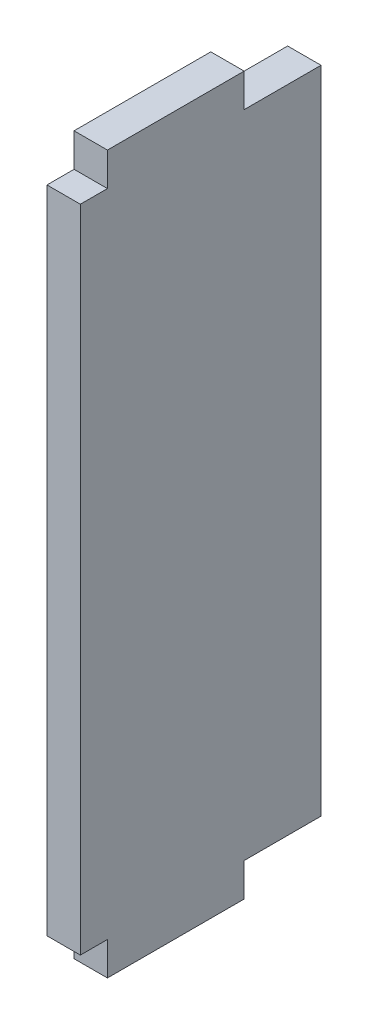
ISO-10303-21;
HEADER;
FILE_DESCRIPTION(('STEP AP214'),'2;1');
FILE_NAME('part.step','',(''),(''),'','','');
FILE_SCHEMA(('AUTOMOTIVE_DESIGN { 1 0 10303 214 1 1 1 1 }'));
ENDSEC;
DATA;
#1=APPLICATION_CONTEXT('core data for automotive mechanical design processes');
#2=APPLICATION_PROTOCOL_DEFINITION('international standard','automotive_design',2000,#1);
#3=PRODUCT_CONTEXT('',#1,'mechanical');
#4=PRODUCT('Part','Part','',(#3));
#5=PRODUCT_RELATED_PRODUCT_CATEGORY('part','',(#4));
#6=PRODUCT_DEFINITION_FORMATION('','',#4);
#7=PRODUCT_DEFINITION_CONTEXT('part definition',#1,'design');
#8=PRODUCT_DEFINITION('design','',#6,#7);
#9=PRODUCT_DEFINITION_SHAPE('','',#8);
#10=(LENGTH_UNIT() NAMED_UNIT(*) SI_UNIT(.MILLI.,.METRE.));
#11=(NAMED_UNIT(*) PLANE_ANGLE_UNIT() SI_UNIT($,.RADIAN.));
#12=(NAMED_UNIT(*) SI_UNIT($,.STERADIAN.) SOLID_ANGLE_UNIT());
#13=UNCERTAINTY_MEASURE_WITH_UNIT(LENGTH_MEASURE(1.E-05),#10,'distance_accuracy_value','');
#14=(GEOMETRIC_REPRESENTATION_CONTEXT(3) GLOBAL_UNCERTAINTY_ASSIGNED_CONTEXT((#13)) GLOBAL_UNIT_ASSIGNED_CONTEXT((#10,
#11,#12)) REPRESENTATION_CONTEXT('',''));
#15=CARTESIAN_POINT('',(0.,0.,0.));
#16=DIRECTION('',(0.,0.,1.));
#17=DIRECTION('',(1.,0.,0.));
#18=AXIS2_PLACEMENT_3D('',#15,#16,#17);
#19=CARTESIAN_POINT('',(2.44,23.78,-3.17999999999999));
#20=DIRECTION('',(0.,-1.,0.));
#21=DIRECTION('',(0.,0.,-1.));
#22=AXIS2_PLACEMENT_3D('',#19,#20,#21);
#23=PLANE('',#22);
#24=DIRECTION('',(0.,0.,1.));
#25=VECTOR('',#24,1.);
#26=CARTESIAN_POINT('',(0.,23.78,-3.17999999999999));
#27=LINE('',#26,#25);
#28=CARTESIAN_POINT('',(0.,23.78,-8.8));
#29=VERTEX_POINT('',#28);
#30=CARTESIAN_POINT('',(0.,23.78,-3.17999999999999));
#31=VERTEX_POINT('',#30);
#32=EDGE_CURVE('E155',#29,#31,#27,.T.);
#33=ORIENTED_EDGE('',*,*,#32,.T.);
#34=DIRECTION('',(-1.,0.,0.));
#35=VECTOR('',#34,1.);
#36=CARTESIAN_POINT('',(2.44,23.78,-3.17999999999999));
#37=LINE('',#36,#35);
#38=CARTESIAN_POINT('',(2.44,23.78,-3.17999999999999));
#39=VERTEX_POINT('',#38);
#40=EDGE_CURVE('E11',#39,#31,#37,.T.);
#41=ORIENTED_EDGE('',*,*,#40,.F.);
#42=DIRECTION('',(0.,0.,1.));
#43=VECTOR('',#42,1.);
#44=CARTESIAN_POINT('',(2.44,23.78,-3.17999999999999));
#45=LINE('',#44,#43);
#46=CARTESIAN_POINT('',(2.44,23.78,-8.8));
#47=VERTEX_POINT('',#46);
#48=EDGE_CURVE('E177',#47,#39,#45,.T.);
#49=ORIENTED_EDGE('',*,*,#48,.F.);
#50=DIRECTION('',(-1.,0.,0.));
#51=VECTOR('',#50,1.);
#52=CARTESIAN_POINT('',(2.44,23.78,-8.8));
#53=LINE('',#52,#51);
#54=EDGE_CURVE('E151',#47,#29,#53,.T.);
#55=ORIENTED_EDGE('',*,*,#54,.T.);
#56=EDGE_LOOP('',(#33,#41,#49,#55));
#57=FACE_BOUND('',#56,.T.);
#58=ADVANCED_FACE('F35',(#57),#23,.F.);
#59=CARTESIAN_POINT('',(2.44,23.78,-3.17999999999999));
#60=DIRECTION('',(0.,0.,1.));
#61=DIRECTION('',(0.,-1.,0.));
#62=AXIS2_PLACEMENT_3D('',#59,#60,#61);
#63=PLANE('',#62);
#64=DIRECTION('',(0.,1.,0.));
#65=VECTOR('',#64,1.);
#66=CARTESIAN_POINT('',(0.,23.78,-3.17999999999999));
#67=LINE('',#66,#65);
#68=CARTESIAN_POINT('',(0.,26.22,-3.17999999999999));
#69=VERTEX_POINT('',#68);
#70=EDGE_CURVE('E158',#31,#69,#67,.T.);
#71=ORIENTED_EDGE('',*,*,#70,.T.);
#72=DIRECTION('',(-1.,0.,0.));
#73=VECTOR('',#72,1.);
#74=CARTESIAN_POINT('',(2.44,26.22,-3.17999999999999));
#75=LINE('',#74,#73);
#76=CARTESIAN_POINT('',(2.44,26.22,-3.17999999999999));
#77=VERTEX_POINT('',#76);
#78=EDGE_CURVE('E43',#77,#69,#75,.T.);
#79=ORIENTED_EDGE('',*,*,#78,.F.);
#80=DIRECTION('',(0.,1.,0.));
#81=VECTOR('',#80,1.);
#82=CARTESIAN_POINT('',(2.44,23.78,-3.17999999999999));
#83=LINE('',#82,#81);
#84=EDGE_CURVE('E106',#39,#77,#83,.T.);
#85=ORIENTED_EDGE('',*,*,#84,.F.);
#86=ORIENTED_EDGE('',*,*,#40,.T.);
#87=EDGE_LOOP('',(#71,#79,#85,#86));
#88=FACE_BOUND('',#87,.T.);
#89=ADVANCED_FACE('F255',(#88),#63,.F.);
#90=CARTESIAN_POINT('',(2.44,26.22,-3.17999999999999));
#91=DIRECTION('',(0.,-1.,0.));
#92=DIRECTION('',(0.,0.,-1.));
#93=AXIS2_PLACEMENT_3D('',#90,#91,#92);
#94=PLANE('',#93);
#95=DIRECTION('',(0.,0.,1.));
#96=VECTOR('',#95,1.);
#97=CARTESIAN_POINT('',(0.,26.22,-3.17999999999999));
#98=LINE('',#97,#96);
#99=CARTESIAN_POINT('',(0.,26.22,6.82000000000001));
#100=VERTEX_POINT('',#99);
#101=EDGE_CURVE('E160',#69,#100,#98,.T.);
#102=ORIENTED_EDGE('',*,*,#101,.T.);
#103=DIRECTION('',(-1.,0.,0.));
#104=VECTOR('',#103,1.);
#105=CARTESIAN_POINT('',(2.44,26.22,6.82000000000001));
#106=LINE('',#105,#104);
#107=CARTESIAN_POINT('',(2.44,26.22,6.82000000000001));
#108=VERTEX_POINT('',#107);
#109=EDGE_CURVE('E196',#108,#100,#106,.T.);
#110=ORIENTED_EDGE('',*,*,#109,.F.);
#111=DIRECTION('',(0.,0.,1.));
#112=VECTOR('',#111,1.);
#113=CARTESIAN_POINT('',(2.44,26.22,-3.17999999999999));
#114=LINE('',#113,#112);
#115=EDGE_CURVE('E204',#77,#108,#114,.T.);
#116=ORIENTED_EDGE('',*,*,#115,.F.);
#117=ORIENTED_EDGE('',*,*,#78,.T.);
#118=EDGE_LOOP('',(#102,#110,#116,#117));
#119=FACE_BOUND('',#118,.T.);
#120=ADVANCED_FACE('F202',(#119),#94,.F.);
#121=CARTESIAN_POINT('',(2.44,23.78,6.82000000000001));
#122=DIRECTION('',(0.,0.,-1.));
#123=DIRECTION('',(-1.,0.,0.));
#124=AXIS2_PLACEMENT_3D('',#121,#122,#123);
#125=PLANE('',#124);
#126=DIRECTION('',(0.,-1.,0.));
#127=VECTOR('',#126,1.);
#128=CARTESIAN_POINT('',(0.,23.78,6.82000000000001));
#129=LINE('',#128,#127);
#130=CARTESIAN_POINT('',(0.,23.78,6.82000000000001));
#131=VERTEX_POINT('',#130);
#132=EDGE_CURVE('E162',#100,#131,#129,.T.);
#133=ORIENTED_EDGE('',*,*,#132,.T.);
#134=DIRECTION('',(-1.,0.,0.));
#135=VECTOR('',#134,1.);
#136=CARTESIAN_POINT('',(2.44,23.78,6.82000000000001));
#137=LINE('',#136,#135);
#138=CARTESIAN_POINT('',(2.44,23.78,6.82000000000001));
#139=VERTEX_POINT('',#138);
#140=EDGE_CURVE('E193',#139,#131,#137,.T.);
#141=ORIENTED_EDGE('',*,*,#140,.F.);
#142=DIRECTION('',(0.,-1.,0.));
#143=VECTOR('',#142,1.);
#144=CARTESIAN_POINT('',(2.44,23.78,6.82000000000001));
#145=LINE('',#144,#143);
#146=EDGE_CURVE('E222',#108,#139,#145,.T.);
#147=ORIENTED_EDGE('',*,*,#146,.F.);
#148=ORIENTED_EDGE('',*,*,#109,.T.);
#149=EDGE_LOOP('',(#133,#141,#147,#148));
#150=FACE_BOUND('',#149,.T.);
#151=ADVANCED_FACE('F213',(#150),#125,.F.);
#152=CARTESIAN_POINT('',(2.44,23.78,8.8));
#153=DIRECTION('',(0.,-1.,0.));
#154=DIRECTION('',(0.,0.,-1.));
#155=AXIS2_PLACEMENT_3D('',#152,#153,#154);
#156=PLANE('',#155);
#157=DIRECTION('',(0.,0.,1.));
#158=VECTOR('',#157,1.);
#159=CARTESIAN_POINT('',(0.,23.78,8.8));
#160=LINE('',#159,#158);
#161=CARTESIAN_POINT('',(0.,23.78,8.8));
#162=VERTEX_POINT('',#161);
#163=EDGE_CURVE('E164',#131,#162,#160,.T.);
#164=ORIENTED_EDGE('',*,*,#163,.T.);
#165=DIRECTION('',(-1.,0.,0.));
#166=VECTOR('',#165,1.);
#167=CARTESIAN_POINT('',(2.44,23.78,8.8));
#168=LINE('',#167,#166);
#169=CARTESIAN_POINT('',(2.44,23.78,8.8));
#170=VERTEX_POINT('',#169);
#171=EDGE_CURVE('E190',#170,#162,#168,.T.);
#172=ORIENTED_EDGE('',*,*,#171,.F.);
#173=DIRECTION('',(0.,0.,1.));
#174=VECTOR('',#173,1.);
#175=CARTESIAN_POINT('',(2.44,23.78,8.8));
#176=LINE('',#175,#174);
#177=EDGE_CURVE('E219',#139,#170,#176,.T.);
#178=ORIENTED_EDGE('',*,*,#177,.F.);
#179=ORIENTED_EDGE('',*,*,#140,.T.);
#180=EDGE_LOOP('',(#164,#172,#178,#179));
#181=FACE_BOUND('',#180,.T.);
#182=ADVANCED_FACE('F217',(#181),#156,.F.);
#183=CARTESIAN_POINT('',(2.44,-23.78,8.8));
#184=DIRECTION('',(0.,0.,-1.));
#185=DIRECTION('',(-1.,0.,0.));
#186=AXIS2_PLACEMENT_3D('',#183,#184,#185);
#187=PLANE('',#186);
#188=DIRECTION('',(0.,-1.,0.));
#189=VECTOR('',#188,1.);
#190=CARTESIAN_POINT('',(0.,-23.78,8.8));
#191=LINE('',#190,#189);
#192=CARTESIAN_POINT('',(0.,-23.78,8.8));
#193=VERTEX_POINT('',#192);
#194=EDGE_CURVE('E166',#162,#193,#191,.T.);
#195=ORIENTED_EDGE('',*,*,#194,.T.);
#196=DIRECTION('',(-1.,0.,0.));
#197=VECTOR('',#196,1.);
#198=CARTESIAN_POINT('',(2.44,-23.78,8.8));
#199=LINE('',#198,#197);
#200=CARTESIAN_POINT('',(2.44,-23.78,8.8));
#201=VERTEX_POINT('',#200);
#202=EDGE_CURVE('E187',#201,#193,#199,.T.);
#203=ORIENTED_EDGE('',*,*,#202,.F.);
#204=DIRECTION('',(0.,-1.,0.));
#205=VECTOR('',#204,1.);
#206=CARTESIAN_POINT('',(2.44,-23.78,8.8));
#207=LINE('',#206,#205);
#208=EDGE_CURVE('E221',#170,#201,#207,.T.);
#209=ORIENTED_EDGE('',*,*,#208,.F.);
#210=ORIENTED_EDGE('',*,*,#171,.T.);
#211=EDGE_LOOP('',(#195,#203,#209,#210));
#212=FACE_BOUND('',#211,.T.);
#213=ADVANCED_FACE('F268',(#212),#187,.F.);
#214=CARTESIAN_POINT('',(2.44,-23.78,8.8));
#215=DIRECTION('',(0.,1.,0.));
#216=DIRECTION('',(0.,0.,1.));
#217=AXIS2_PLACEMENT_3D('',#214,#215,#216);
#218=PLANE('',#217);
#219=DIRECTION('',(0.,0.,-1.));
#220=VECTOR('',#219,1.);
#221=CARTESIAN_POINT('',(0.,-23.78,8.8));
#222=LINE('',#221,#220);
#223=CARTESIAN_POINT('',(0.,-23.78,6.82));
#224=VERTEX_POINT('',#223);
#225=EDGE_CURVE('E168',#193,#224,#222,.T.);
#226=ORIENTED_EDGE('',*,*,#225,.T.);
#227=DIRECTION('',(-1.,0.,0.));
#228=VECTOR('',#227,1.);
#229=CARTESIAN_POINT('',(2.44,-23.78,6.82));
#230=LINE('',#229,#228);
#231=CARTESIAN_POINT('',(2.44,-23.78,6.82));
#232=VERTEX_POINT('',#231);
#233=EDGE_CURVE('E184',#232,#224,#230,.T.);
#234=ORIENTED_EDGE('',*,*,#233,.F.);
#235=DIRECTION('',(0.,0.,-1.));
#236=VECTOR('',#235,1.);
#237=CARTESIAN_POINT('',(2.44,-23.78,8.8));
#238=LINE('',#237,#236);
#239=EDGE_CURVE('E224',#201,#232,#238,.T.);
#240=ORIENTED_EDGE('',*,*,#239,.F.);
#241=ORIENTED_EDGE('',*,*,#202,.T.);
#242=EDGE_LOOP('',(#226,#234,#240,#241));
#243=FACE_BOUND('',#242,.T.);
#244=ADVANCED_FACE('F271',(#243),#218,.F.);
#245=CARTESIAN_POINT('',(2.44,-23.78,6.82));
#246=DIRECTION('',(0.,0.,-1.));
#247=DIRECTION('',(-1.,0.,0.));
#248=AXIS2_PLACEMENT_3D('',#245,#246,#247);
#249=PLANE('',#248);
#250=DIRECTION('',(0.,-1.,0.));
#251=VECTOR('',#250,1.);
#252=CARTESIAN_POINT('',(0.,-23.78,6.82));
#253=LINE('',#252,#251);
#254=CARTESIAN_POINT('',(0.,-26.22,6.82));
#255=VERTEX_POINT('',#254);
#256=EDGE_CURVE('E170',#224,#255,#253,.T.);
#257=ORIENTED_EDGE('',*,*,#256,.T.);
#258=DIRECTION('',(-1.,0.,0.));
#259=VECTOR('',#258,1.);
#260=CARTESIAN_POINT('',(2.44,-26.22,6.82));
#261=LINE('',#260,#259);
#262=CARTESIAN_POINT('',(2.44,-26.22,6.82));
#263=VERTEX_POINT('',#262);
#264=EDGE_CURVE('E181',#263,#255,#261,.T.);
#265=ORIENTED_EDGE('',*,*,#264,.F.);
#266=DIRECTION('',(0.,-1.,0.));
#267=VECTOR('',#266,1.);
#268=CARTESIAN_POINT('',(2.44,-23.78,6.82));
#269=LINE('',#268,#267);
#270=EDGE_CURVE('E230',#232,#263,#269,.T.);
#271=ORIENTED_EDGE('',*,*,#270,.F.);
#272=ORIENTED_EDGE('',*,*,#233,.T.);
#273=EDGE_LOOP('',(#257,#265,#271,#272));
#274=FACE_BOUND('',#273,.T.);
#275=ADVANCED_FACE('F236',(#274),#249,.F.);
#276=CARTESIAN_POINT('',(2.44,-26.22,-3.18));
#277=DIRECTION('',(0.,1.,0.));
#278=DIRECTION('',(0.,0.,1.));
#279=AXIS2_PLACEMENT_3D('',#276,#277,#278);
#280=PLANE('',#279);
#281=DIRECTION('',(0.,0.,-1.));
#282=VECTOR('',#281,1.);
#283=CARTESIAN_POINT('',(0.,-26.22,-3.18));
#284=LINE('',#283,#282);
#285=CARTESIAN_POINT('',(0.,-26.22,-3.18));
#286=VERTEX_POINT('',#285);
#287=EDGE_CURVE('E172',#255,#286,#284,.T.);
#288=ORIENTED_EDGE('',*,*,#287,.T.);
#289=DIRECTION('',(-1.,0.,0.));
#290=VECTOR('',#289,1.);
#291=CARTESIAN_POINT('',(2.44,-26.22,-3.18));
#292=LINE('',#291,#290);
#293=CARTESIAN_POINT('',(2.44,-26.22,-3.18));
#294=VERTEX_POINT('',#293);
#295=EDGE_CURVE('E146',#294,#286,#292,.T.);
#296=ORIENTED_EDGE('',*,*,#295,.F.);
#297=DIRECTION('',(0.,0.,-1.));
#298=VECTOR('',#297,1.);
#299=CARTESIAN_POINT('',(2.44,-26.22,-3.18));
#300=LINE('',#299,#298);
#301=EDGE_CURVE('E137',#263,#294,#300,.T.);
#302=ORIENTED_EDGE('',*,*,#301,.F.);
#303=ORIENTED_EDGE('',*,*,#264,.T.);
#304=EDGE_LOOP('',(#288,#296,#302,#303));
#305=FACE_BOUND('',#304,.T.);
#306=ADVANCED_FACE('F240',(#305),#280,.F.);
#307=CARTESIAN_POINT('',(2.44,-23.78,-3.18));
#308=DIRECTION('',(0.,0.,1.));
#309=DIRECTION('',(1.,0.,0.));
#310=AXIS2_PLACEMENT_3D('',#307,#308,#309);
#311=PLANE('',#310);
#312=DIRECTION('',(0.,1.,0.));
#313=VECTOR('',#312,1.);
#314=CARTESIAN_POINT('',(0.,-23.78,-3.18));
#315=LINE('',#314,#313);
#316=CARTESIAN_POINT('',(0.,-23.78,-3.18));
#317=VERTEX_POINT('',#316);
#318=EDGE_CURVE('E145',#286,#317,#315,.T.);
#319=ORIENTED_EDGE('',*,*,#318,.T.);
#320=DIRECTION('',(-1.,0.,0.));
#321=VECTOR('',#320,1.);
#322=CARTESIAN_POINT('',(2.44,-23.78,-3.18));
#323=LINE('',#322,#321);
#324=CARTESIAN_POINT('',(2.44,-23.78,-3.18));
#325=VERTEX_POINT('',#324);
#326=EDGE_CURVE('E142',#325,#317,#323,.T.);
#327=ORIENTED_EDGE('',*,*,#326,.F.);
#328=DIRECTION('',(0.,1.,0.));
#329=VECTOR('',#328,1.);
#330=CARTESIAN_POINT('',(2.44,-23.78,-3.18));
#331=LINE('',#330,#329);
#332=EDGE_CURVE('E131',#294,#325,#331,.T.);
#333=ORIENTED_EDGE('',*,*,#332,.F.);
#334=ORIENTED_EDGE('',*,*,#295,.T.);
#335=EDGE_LOOP('',(#319,#327,#333,#334));
#336=FACE_BOUND('',#335,.T.);
#337=ADVANCED_FACE('F143',(#336),#311,.F.);
#338=CARTESIAN_POINT('',(2.44,-23.78,-3.18));
#339=DIRECTION('',(0.,1.,0.));
#340=DIRECTION('',(0.,0.,1.));
#341=AXIS2_PLACEMENT_3D('',#338,#339,#340);
#342=PLANE('',#341);
#343=DIRECTION('',(0.,0.,-1.));
#344=VECTOR('',#343,1.);
#345=CARTESIAN_POINT('',(0.,-23.78,-3.18));
#346=LINE('',#345,#344);
#347=CARTESIAN_POINT('',(0.,-23.78,-8.8));
#348=VERTEX_POINT('',#347);
#349=EDGE_CURVE('E92',#317,#348,#346,.T.);
#350=ORIENTED_EDGE('',*,*,#349,.T.);
#351=DIRECTION('',(-1.,0.,0.));
#352=VECTOR('',#351,1.);
#353=CARTESIAN_POINT('',(2.44,-23.78,-8.8));
#354=LINE('',#353,#352);
#355=CARTESIAN_POINT('',(2.44,-23.78,-8.8));
#356=VERTEX_POINT('',#355);
#357=EDGE_CURVE('E147',#356,#348,#354,.T.);
#358=ORIENTED_EDGE('',*,*,#357,.F.);
#359=DIRECTION('',(0.,0.,-1.));
#360=VECTOR('',#359,1.);
#361=CARTESIAN_POINT('',(2.44,-23.78,-3.18));
#362=LINE('',#361,#360);
#363=EDGE_CURVE('E135',#325,#356,#362,.T.);
#364=ORIENTED_EDGE('',*,*,#363,.F.);
#365=ORIENTED_EDGE('',*,*,#326,.T.);
#366=EDGE_LOOP('',(#350,#358,#364,#365));
#367=FACE_BOUND('',#366,.T.);
#368=ADVANCED_FACE('F149',(#367),#342,.F.);
#369=CARTESIAN_POINT('',(2.44,-23.78,-8.8));
#370=DIRECTION('',(0.,0.,1.));
#371=DIRECTION('',(1.,0.,0.));
#372=AXIS2_PLACEMENT_3D('',#369,#370,#371);
#373=PLANE('',#372);
#374=DIRECTION('',(0.,1.,0.));
#375=VECTOR('',#374,1.);
#376=CARTESIAN_POINT('',(0.,-23.78,-8.8));
#377=LINE('',#376,#375);
#378=EDGE_CURVE('E98',#348,#29,#377,.T.);
#379=ORIENTED_EDGE('',*,*,#378,.T.);
#380=ORIENTED_EDGE('',*,*,#54,.F.);
#381=DIRECTION('',(0.,1.,0.));
#382=VECTOR('',#381,1.);
#383=CARTESIAN_POINT('',(2.44,-23.78,-8.8));
#384=LINE('',#383,#382);
#385=EDGE_CURVE('E51',#356,#47,#384,.T.);
#386=ORIENTED_EDGE('',*,*,#385,.F.);
#387=ORIENTED_EDGE('',*,*,#357,.T.);
#388=EDGE_LOOP('',(#379,#380,#386,#387));
#389=FACE_BOUND('',#388,.T.);
#390=ADVANCED_FACE('F244',(#389),#373,.F.);
#391=CARTESIAN_POINT('',(2.44,0.,0.));
#392=DIRECTION('',(1.,0.,0.));
#393=DIRECTION('',(0.,0.,-1.));
#394=AXIS2_PLACEMENT_3D('',#391,#392,#393);
#395=PLANE('',#394);
#396=ORIENTED_EDGE('',*,*,#48,.T.);
#397=ORIENTED_EDGE('',*,*,#84,.T.);
#398=ORIENTED_EDGE('',*,*,#115,.T.);
#399=ORIENTED_EDGE('',*,*,#146,.T.);
#400=ORIENTED_EDGE('',*,*,#177,.T.);
#401=ORIENTED_EDGE('',*,*,#208,.T.);
#402=ORIENTED_EDGE('',*,*,#239,.T.);
#403=ORIENTED_EDGE('',*,*,#270,.T.);
#404=ORIENTED_EDGE('',*,*,#301,.T.);
#405=ORIENTED_EDGE('',*,*,#332,.T.);
#406=ORIENTED_EDGE('',*,*,#363,.T.);
#407=ORIENTED_EDGE('',*,*,#385,.T.);
#408=EDGE_LOOP('',(#396,#397,#398,#399,#400,#401,#402,#403,#404,#405,#406,#407));
#409=FACE_BOUND('',#408,.T.);
#410=ADVANCED_FACE('F133',(#409),#395,.T.);
#411=CARTESIAN_POINT('',(0.,0.,0.));
#412=DIRECTION('',(1.,0.,0.));
#413=DIRECTION('',(0.,0.,-1.));
#414=AXIS2_PLACEMENT_3D('',#411,#412,#413);
#415=PLANE('',#414);
#416=ORIENTED_EDGE('',*,*,#32,.F.);
#417=ORIENTED_EDGE('',*,*,#378,.F.);
#418=ORIENTED_EDGE('',*,*,#349,.F.);
#419=ORIENTED_EDGE('',*,*,#318,.F.);
#420=ORIENTED_EDGE('',*,*,#287,.F.);
#421=ORIENTED_EDGE('',*,*,#256,.F.);
#422=ORIENTED_EDGE('',*,*,#225,.F.);
#423=ORIENTED_EDGE('',*,*,#194,.F.);
#424=ORIENTED_EDGE('',*,*,#163,.F.);
#425=ORIENTED_EDGE('',*,*,#132,.F.);
#426=ORIENTED_EDGE('',*,*,#101,.F.);
#427=ORIENTED_EDGE('',*,*,#70,.F.);
#428=EDGE_LOOP('',(#416,#417,#418,#419,#420,#421,#422,#423,#424,#425,#426,#427));
#429=FACE_BOUND('',#428,.T.);
#430=ADVANCED_FACE('F208',(#429),#415,.F.);
#431=CLOSED_SHELL('',(#58,#89,#120,#151,#182,#213,#244,#275,#306,#337,#368,#390,#410,#430));
#432=MANIFOLD_SOLID_BREP('B2',#431);
#433=ADVANCED_BREP_SHAPE_REPRESENTATION('',(#18,#432),#14);
#434=SHAPE_DEFINITION_REPRESENTATION(#9,#433);
ENDSEC;
END-ISO-10303-21;
